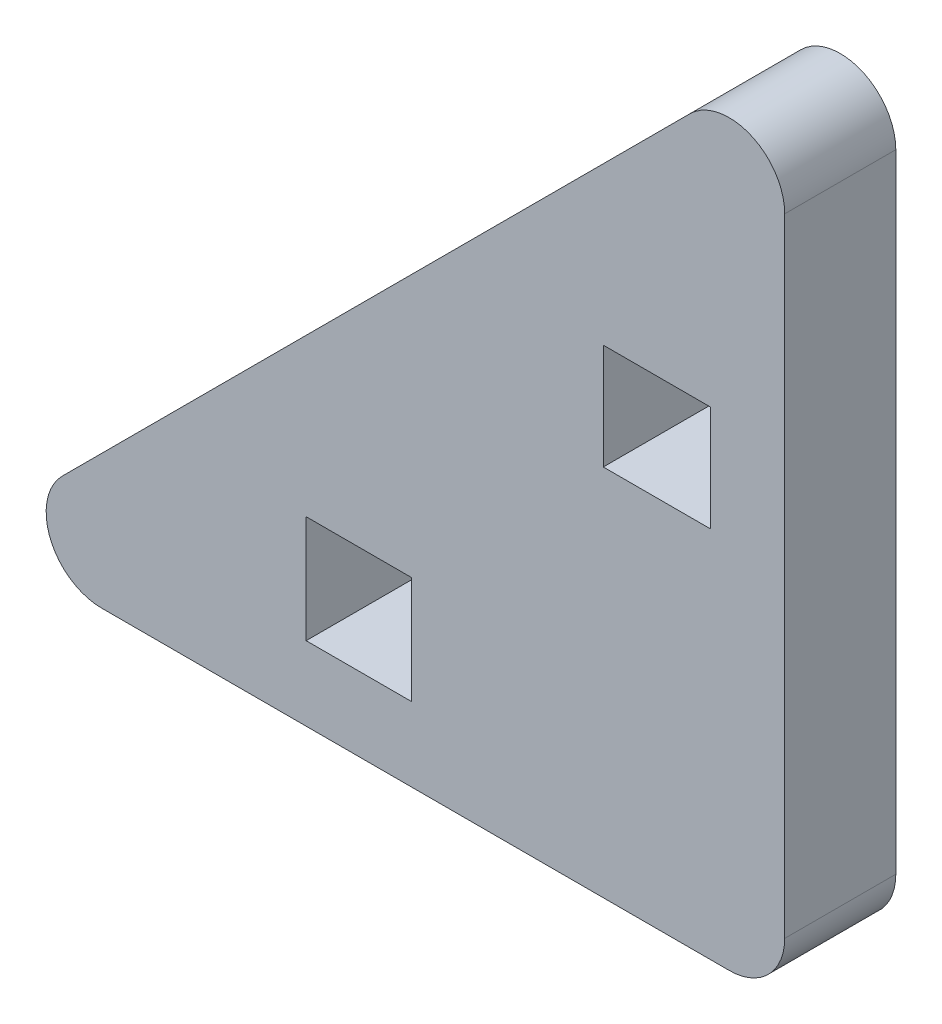
ISO-10303-21;
HEADER;
FILE_DESCRIPTION(('STEP AP214'),'2;1');
FILE_NAME('part.step','',(''),(''),'','','');
FILE_SCHEMA(('AUTOMOTIVE_DESIGN { 1 0 10303 214 1 1 1 1 }'));
ENDSEC;
DATA;
#1=APPLICATION_CONTEXT('core data for automotive mechanical design processes');
#2=APPLICATION_PROTOCOL_DEFINITION('international standard','automotive_design',2000,#1);
#3=PRODUCT_CONTEXT('',#1,'mechanical');
#4=PRODUCT('Part','Part','',(#3));
#5=PRODUCT_RELATED_PRODUCT_CATEGORY('part','',(#4));
#6=PRODUCT_DEFINITION_FORMATION('','',#4);
#7=PRODUCT_DEFINITION_CONTEXT('part definition',#1,'design');
#8=PRODUCT_DEFINITION('design','',#6,#7);
#9=PRODUCT_DEFINITION_SHAPE('','',#8);
#10=(LENGTH_UNIT() NAMED_UNIT(*) SI_UNIT(.MILLI.,.METRE.));
#11=(NAMED_UNIT(*) PLANE_ANGLE_UNIT() SI_UNIT($,.RADIAN.));
#12=(NAMED_UNIT(*) SI_UNIT($,.STERADIAN.) SOLID_ANGLE_UNIT());
#13=UNCERTAINTY_MEASURE_WITH_UNIT(LENGTH_MEASURE(1.E-05),#10,'distance_accuracy_value','');
#14=(GEOMETRIC_REPRESENTATION_CONTEXT(3) GLOBAL_UNCERTAINTY_ASSIGNED_CONTEXT((#13)) GLOBAL_UNIT_ASSIGNED_CONTEXT((#10,
#11,#12)) REPRESENTATION_CONTEXT('',''));
#15=CARTESIAN_POINT('',(0.,0.,0.));
#16=DIRECTION('',(0.,0.,1.));
#17=DIRECTION('',(1.,0.,0.));
#18=AXIS2_PLACEMENT_3D('',#15,#16,#17);
#19=CARTESIAN_POINT('',(0.,0.,3.));
#20=DIRECTION('',(1.,0.,0.));
#21=DIRECTION('',(0.,1.,0.));
#22=AXIS2_PLACEMENT_3D('',#19,#20,#21);
#23=PLANE('',#22);
#24=DIRECTION('',(0.,-1.,0.));
#25=VECTOR('',#24,1.);
#26=CARTESIAN_POINT('',(0.,0.,3.));
#27=LINE('',#26,#25);
#28=CARTESIAN_POINT('',(0.,18.4463203435596,3.));
#29=VERTEX_POINT('',#28);
#30=CARTESIAN_POINT('',(0.,1.5,3.));
#31=VERTEX_POINT('',#30);
#32=EDGE_CURVE('E195',#29,#31,#27,.T.);
#33=ORIENTED_EDGE('',*,*,#32,.T.);
#34=DIRECTION('',(0.,0.,-1.));
#35=VECTOR('',#34,1.);
#36=CARTESIAN_POINT('',(0.,1.5,3.));
#37=LINE('',#36,#35);
#38=CARTESIAN_POINT('',(0.,1.5,0.));
#39=VERTEX_POINT('',#38);
#40=EDGE_CURVE('E269',#31,#39,#37,.T.);
#41=ORIENTED_EDGE('',*,*,#40,.T.);
#42=DIRECTION('',(0.,-1.,0.));
#43=VECTOR('',#42,1.);
#44=CARTESIAN_POINT('',(0.,0.,0.));
#45=LINE('',#44,#43);
#46=CARTESIAN_POINT('',(0.,18.4463203435596,0.));
#47=VERTEX_POINT('',#46);
#48=EDGE_CURVE('E235',#47,#39,#45,.T.);
#49=ORIENTED_EDGE('',*,*,#48,.F.);
#50=DIRECTION('',(0.,0.,-1.));
#51=VECTOR('',#50,1.);
#52=CARTESIAN_POINT('',(0.,18.4463203435596,3.));
#53=LINE('',#52,#51);
#54=EDGE_CURVE('E258',#47,#29,#53,.F.);
#55=ORIENTED_EDGE('',*,*,#54,.T.);
#56=EDGE_LOOP('',(#33,#41,#49,#55));
#57=FACE_BOUND('',#56,.T.);
#58=ADVANCED_FACE('F43',(#57),#23,.T.);
#59=CARTESIAN_POINT('',(-11.0338203435596,11.0338203435596,3.));
#60=DIRECTION('',(-0.707106781186547,0.707106781186547,0.));
#61=DIRECTION('',(-0.707106781186548,-0.707106781186548,0.));
#62=AXIS2_PLACEMENT_3D('',#59,#60,#61);
#63=PLANE('',#62);
#64=DIRECTION('',(0.707106781186548,0.707106781186548,0.));
#65=VECTOR('',#64,1.);
#66=CARTESIAN_POINT('',(-11.0338203435596,11.0338203435596,0.));
#67=LINE('',#66,#65);
#68=CARTESIAN_POINT('',(-19.5069805153395,2.56066017177982,0.));
#69=VERTEX_POINT('',#68);
#70=CARTESIAN_POINT('',(-2.56066017177982,19.5069805153395,0.));
#71=VERTEX_POINT('',#70);
#72=EDGE_CURVE('E239',#69,#71,#67,.T.);
#73=ORIENTED_EDGE('',*,*,#72,.F.);
#74=DIRECTION('',(0.,0.,-1.));
#75=VECTOR('',#74,1.);
#76=CARTESIAN_POINT('',(-19.5069805153395,2.56066017177982,3.));
#77=LINE('',#76,#75);
#78=CARTESIAN_POINT('',(-19.5069805153395,2.56066017177982,3.));
#79=VERTEX_POINT('',#78);
#80=EDGE_CURVE('E11',#69,#79,#77,.F.);
#81=ORIENTED_EDGE('',*,*,#80,.T.);
#82=DIRECTION('',(0.707106781186548,0.707106781186548,0.));
#83=VECTOR('',#82,1.);
#84=CARTESIAN_POINT('',(-11.0338203435596,11.0338203435596,3.));
#85=LINE('',#84,#83);
#86=CARTESIAN_POINT('',(-2.56066017177982,19.5069805153395,3.));
#87=VERTEX_POINT('',#86);
#88=EDGE_CURVE('E199',#79,#87,#85,.T.);
#89=ORIENTED_EDGE('',*,*,#88,.T.);
#90=DIRECTION('',(0.,0.,-1.));
#91=VECTOR('',#90,1.);
#92=CARTESIAN_POINT('',(-2.56066017177982,19.5069805153395,3.));
#93=LINE('',#92,#91);
#94=EDGE_CURVE('E52',#87,#71,#93,.T.);
#95=ORIENTED_EDGE('',*,*,#94,.T.);
#96=EDGE_LOOP('',(#73,#81,#89,#95));
#97=FACE_BOUND('',#96,.T.);
#98=ADVANCED_FACE('F299',(#97),#63,.T.);
#99=CARTESIAN_POINT('',(-2.00000000000001,0.,3.));
#100=DIRECTION('',(-1.,0.,0.));
#101=DIRECTION('',(0.,-1.,0.));
#102=AXIS2_PLACEMENT_3D('',#99,#100,#101);
#103=PLANE('',#102);
#104=DIRECTION('',(0.,1.,0.));
#105=VECTOR('',#104,1.);
#106=CARTESIAN_POINT('',(-2.00000000000001,0.,0.));
#107=LINE('',#106,#105);
#108=CARTESIAN_POINT('',(-2.,10.075,0.));
#109=VERTEX_POINT('',#108);
#110=CARTESIAN_POINT('',(-2.,12.925,0.));
#111=VERTEX_POINT('',#110);
#112=EDGE_CURVE('E219',#109,#111,#107,.T.);
#113=ORIENTED_EDGE('',*,*,#112,.F.);
#114=DIRECTION('',(0.,0.,-1.));
#115=VECTOR('',#114,1.);
#116=CARTESIAN_POINT('',(-2.,10.075,3.));
#117=LINE('',#116,#115);
#118=CARTESIAN_POINT('',(-2.,10.075,3.));
#119=VERTEX_POINT('',#118);
#120=EDGE_CURVE('E255',#119,#109,#117,.T.);
#121=ORIENTED_EDGE('',*,*,#120,.F.);
#122=DIRECTION('',(0.,1.,0.));
#123=VECTOR('',#122,1.);
#124=CARTESIAN_POINT('',(-2.00000000000001,0.,3.));
#125=LINE('',#124,#123);
#126=CARTESIAN_POINT('',(-2.,12.925,3.));
#127=VERTEX_POINT('',#126);
#128=EDGE_CURVE('E180',#119,#127,#125,.T.);
#129=ORIENTED_EDGE('',*,*,#128,.T.);
#130=DIRECTION('',(0.,0.,-1.));
#131=VECTOR('',#130,1.);
#132=CARTESIAN_POINT('',(-2.,12.925,3.));
#133=LINE('',#132,#131);
#134=EDGE_CURVE('E156',#127,#111,#133,.T.);
#135=ORIENTED_EDGE('',*,*,#134,.T.);
#136=EDGE_LOOP('',(#113,#121,#129,#135));
#137=FACE_BOUND('',#136,.T.);
#138=ADVANCED_FACE('F328',(#137),#103,.T.);
#139=CARTESIAN_POINT('',(0.,10.075,3.));
#140=DIRECTION('',(0.,1.,0.));
#141=DIRECTION('',(-1.,0.,0.));
#142=AXIS2_PLACEMENT_3D('',#139,#140,#141);
#143=PLANE('',#142);
#144=DIRECTION('',(1.,0.,0.));
#145=VECTOR('',#144,1.);
#146=CARTESIAN_POINT('',(0.,10.075,0.));
#147=LINE('',#146,#145);
#148=CARTESIAN_POINT('',(-4.9,10.075,0.));
#149=VERTEX_POINT('',#148);
#150=EDGE_CURVE('E223',#149,#109,#147,.T.);
#151=ORIENTED_EDGE('',*,*,#150,.F.);
#152=DIRECTION('',(0.,0.,-1.));
#153=VECTOR('',#152,1.);
#154=CARTESIAN_POINT('',(-4.9,10.075,3.));
#155=LINE('',#154,#153);
#156=CARTESIAN_POINT('',(-4.9,10.075,3.));
#157=VERTEX_POINT('',#156);
#158=EDGE_CURVE('E252',#157,#149,#155,.T.);
#159=ORIENTED_EDGE('',*,*,#158,.F.);
#160=DIRECTION('',(1.,0.,0.));
#161=VECTOR('',#160,1.);
#162=CARTESIAN_POINT('',(0.,10.075,3.));
#163=LINE('',#162,#161);
#164=EDGE_CURVE('E184',#157,#119,#163,.T.);
#165=ORIENTED_EDGE('',*,*,#164,.T.);
#166=ORIENTED_EDGE('',*,*,#120,.T.);
#167=EDGE_LOOP('',(#151,#159,#165,#166));
#168=FACE_BOUND('',#167,.T.);
#169=ADVANCED_FACE('F341',(#168),#143,.T.);
#170=CARTESIAN_POINT('',(-4.9,0.,3.));
#171=DIRECTION('',(-1.,0.,0.));
#172=DIRECTION('',(0.,0.,1.));
#173=AXIS2_PLACEMENT_3D('',#170,#171,#172);
#174=PLANE('',#173);
#175=DIRECTION('',(0.,1.,0.));
#176=VECTOR('',#175,1.);
#177=CARTESIAN_POINT('',(-4.9,0.,0.));
#178=LINE('',#177,#176);
#179=CARTESIAN_POINT('',(-4.9,12.925,0.));
#180=VERTEX_POINT('',#179);
#181=EDGE_CURVE('E227',#149,#180,#178,.T.);
#182=ORIENTED_EDGE('',*,*,#181,.T.);
#183=DIRECTION('',(0.,0.,-1.));
#184=VECTOR('',#183,1.);
#185=CARTESIAN_POINT('',(-4.9,12.925,3.));
#186=LINE('',#185,#184);
#187=CARTESIAN_POINT('',(-4.9,12.925,3.));
#188=VERTEX_POINT('',#187);
#189=EDGE_CURVE('E248',#188,#180,#186,.T.);
#190=ORIENTED_EDGE('',*,*,#189,.F.);
#191=DIRECTION('',(0.,1.,0.));
#192=VECTOR('',#191,1.);
#193=CARTESIAN_POINT('',(-4.9,0.,3.));
#194=LINE('',#193,#192);
#195=EDGE_CURVE('E188',#157,#188,#194,.T.);
#196=ORIENTED_EDGE('',*,*,#195,.F.);
#197=ORIENTED_EDGE('',*,*,#158,.T.);
#198=EDGE_LOOP('',(#182,#190,#196,#197));
#199=FACE_BOUND('',#198,.T.);
#200=ADVANCED_FACE('F338',(#199),#174,.F.);
#201=CARTESIAN_POINT('',(-10.075,0.,3.));
#202=DIRECTION('',(-1.,0.,0.));
#203=DIRECTION('',(0.,0.,1.));
#204=AXIS2_PLACEMENT_3D('',#201,#202,#203);
#205=PLANE('',#204);
#206=DIRECTION('',(0.,1.,0.));
#207=VECTOR('',#206,1.);
#208=CARTESIAN_POINT('',(-10.075,0.,0.));
#209=LINE('',#208,#207);
#210=CARTESIAN_POINT('',(-10.075,2.,0.));
#211=VERTEX_POINT('',#210);
#212=CARTESIAN_POINT('',(-10.075,4.9,0.));
#213=VERTEX_POINT('',#212);
#214=EDGE_CURVE('E150',#211,#213,#209,.T.);
#215=ORIENTED_EDGE('',*,*,#214,.F.);
#216=DIRECTION('',(0.,0.,-1.));
#217=VECTOR('',#216,1.);
#218=CARTESIAN_POINT('',(-10.075,2.,3.));
#219=LINE('',#218,#217);
#220=CARTESIAN_POINT('',(-10.075,2.,3.));
#221=VERTEX_POINT('',#220);
#222=EDGE_CURVE('E145',#221,#211,#219,.T.);
#223=ORIENTED_EDGE('',*,*,#222,.F.);
#224=DIRECTION('',(0.,1.,0.));
#225=VECTOR('',#224,1.);
#226=CARTESIAN_POINT('',(-10.075,0.,3.));
#227=LINE('',#226,#225);
#228=CARTESIAN_POINT('',(-10.075,4.9,3.));
#229=VERTEX_POINT('',#228);
#230=EDGE_CURVE('E148',#221,#229,#227,.T.);
#231=ORIENTED_EDGE('',*,*,#230,.T.);
#232=DIRECTION('',(0.,0.,-1.));
#233=VECTOR('',#232,1.);
#234=CARTESIAN_POINT('',(-10.075,4.9,3.));
#235=LINE('',#234,#233);
#236=EDGE_CURVE('E206',#229,#213,#235,.T.);
#237=ORIENTED_EDGE('',*,*,#236,.T.);
#238=EDGE_LOOP('',(#215,#223,#231,#237));
#239=FACE_BOUND('',#238,.T.);
#240=ADVANCED_FACE('F147',(#239),#205,.T.);
#241=CARTESIAN_POINT('',(0.,2.,3.));
#242=DIRECTION('',(0.,1.,0.));
#243=DIRECTION('',(0.,0.,1.));
#244=AXIS2_PLACEMENT_3D('',#241,#242,#243);
#245=PLANE('',#244);
#246=DIRECTION('',(1.,0.,0.));
#247=VECTOR('',#246,1.);
#248=CARTESIAN_POINT('',(0.,2.,0.));
#249=LINE('',#248,#247);
#250=CARTESIAN_POINT('',(-12.925,2.,0.));
#251=VERTEX_POINT('',#250);
#252=EDGE_CURVE('E209',#251,#211,#249,.T.);
#253=ORIENTED_EDGE('',*,*,#252,.F.);
#254=DIRECTION('',(0.,0.,-1.));
#255=VECTOR('',#254,1.);
#256=CARTESIAN_POINT('',(-12.925,2.,3.));
#257=LINE('',#256,#255);
#258=CARTESIAN_POINT('',(-12.925,2.,3.));
#259=VERTEX_POINT('',#258);
#260=EDGE_CURVE('E157',#259,#251,#257,.T.);
#261=ORIENTED_EDGE('',*,*,#260,.F.);
#262=DIRECTION('',(1.,0.,0.));
#263=VECTOR('',#262,1.);
#264=CARTESIAN_POINT('',(0.,2.,3.));
#265=LINE('',#264,#263);
#266=EDGE_CURVE('E163',#259,#221,#265,.T.);
#267=ORIENTED_EDGE('',*,*,#266,.T.);
#268=ORIENTED_EDGE('',*,*,#222,.T.);
#269=EDGE_LOOP('',(#253,#261,#267,#268));
#270=FACE_BOUND('',#269,.T.);
#271=ADVANCED_FACE('F170',(#270),#245,.T.);
#272=CARTESIAN_POINT('',(-12.925,0.,3.));
#273=DIRECTION('',(-1.,0.,0.));
#274=DIRECTION('',(0.,0.,1.));
#275=AXIS2_PLACEMENT_3D('',#272,#273,#274);
#276=PLANE('',#275);
#277=DIRECTION('',(0.,1.,0.));
#278=VECTOR('',#277,1.);
#279=CARTESIAN_POINT('',(-12.925,0.,0.));
#280=LINE('',#279,#278);
#281=CARTESIAN_POINT('',(-12.925,4.9,0.));
#282=VERTEX_POINT('',#281);
#283=EDGE_CURVE('E212',#251,#282,#280,.T.);
#284=ORIENTED_EDGE('',*,*,#283,.T.);
#285=DIRECTION('',(0.,0.,-1.));
#286=VECTOR('',#285,1.);
#287=CARTESIAN_POINT('',(-12.925,4.9,3.));
#288=LINE('',#287,#286);
#289=CARTESIAN_POINT('',(-12.925,4.9,3.));
#290=VERTEX_POINT('',#289);
#291=EDGE_CURVE('E261',#290,#282,#288,.T.);
#292=ORIENTED_EDGE('',*,*,#291,.F.);
#293=DIRECTION('',(0.,1.,0.));
#294=VECTOR('',#293,1.);
#295=CARTESIAN_POINT('',(-12.925,0.,3.));
#296=LINE('',#295,#294);
#297=EDGE_CURVE('E173',#259,#290,#296,.T.);
#298=ORIENTED_EDGE('',*,*,#297,.F.);
#299=ORIENTED_EDGE('',*,*,#260,.T.);
#300=EDGE_LOOP('',(#284,#292,#298,#299));
#301=FACE_BOUND('',#300,.T.);
#302=ADVANCED_FACE('F336',(#301),#276,.F.);
#303=CARTESIAN_POINT('',(0.,12.925,3.));
#304=DIRECTION('',(0.,1.,0.));
#305=DIRECTION('',(0.,0.,1.));
#306=AXIS2_PLACEMENT_3D('',#303,#304,#305);
#307=PLANE('',#306);
#308=DIRECTION('',(1.,0.,0.));
#309=VECTOR('',#308,1.);
#310=CARTESIAN_POINT('',(0.,12.925,0.));
#311=LINE('',#310,#309);
#312=EDGE_CURVE('E231',#180,#111,#311,.T.);
#313=ORIENTED_EDGE('',*,*,#312,.T.);
#314=ORIENTED_EDGE('',*,*,#134,.F.);
#315=DIRECTION('',(1.,0.,0.));
#316=VECTOR('',#315,1.);
#317=CARTESIAN_POINT('',(0.,12.925,3.));
#318=LINE('',#317,#316);
#319=EDGE_CURVE('E192',#188,#127,#318,.T.);
#320=ORIENTED_EDGE('',*,*,#319,.F.);
#321=ORIENTED_EDGE('',*,*,#189,.T.);
#322=EDGE_LOOP('',(#313,#314,#320,#321));
#323=FACE_BOUND('',#322,.T.);
#324=ADVANCED_FACE('F332',(#323),#307,.F.);
#325=CARTESIAN_POINT('',(0.,4.9,3.));
#326=DIRECTION('',(0.,1.,0.));
#327=DIRECTION('',(0.,0.,1.));
#328=AXIS2_PLACEMENT_3D('',#325,#326,#327);
#329=PLANE('',#328);
#330=DIRECTION('',(1.,0.,0.));
#331=VECTOR('',#330,1.);
#332=CARTESIAN_POINT('',(0.,4.9,0.));
#333=LINE('',#332,#331);
#334=EDGE_CURVE('E215',#282,#213,#333,.T.);
#335=ORIENTED_EDGE('',*,*,#334,.T.);
#336=ORIENTED_EDGE('',*,*,#236,.F.);
#337=DIRECTION('',(1.,0.,0.));
#338=VECTOR('',#337,1.);
#339=CARTESIAN_POINT('',(0.,4.9,3.));
#340=LINE('',#339,#338);
#341=EDGE_CURVE('E165',#290,#229,#340,.T.);
#342=ORIENTED_EDGE('',*,*,#341,.F.);
#343=ORIENTED_EDGE('',*,*,#291,.T.);
#344=EDGE_LOOP('',(#335,#336,#342,#343));
#345=FACE_BOUND('',#344,.T.);
#346=ADVANCED_FACE('F335',(#345),#329,.F.);
#347=CARTESIAN_POINT('',(0.,0.,3.));
#348=DIRECTION('',(0.,-1.,0.));
#349=DIRECTION('',(0.,0.,-1.));
#350=AXIS2_PLACEMENT_3D('',#347,#348,#349);
#351=PLANE('',#350);
#352=DIRECTION('',(-1.,0.,0.));
#353=VECTOR('',#352,1.);
#354=CARTESIAN_POINT('',(0.,0.,0.));
#355=LINE('',#354,#353);
#356=CARTESIAN_POINT('',(-1.5,0.,0.));
#357=VERTEX_POINT('',#356);
#358=CARTESIAN_POINT('',(-18.4463203435596,0.,0.));
#359=VERTEX_POINT('',#358);
#360=EDGE_CURVE('E168',#357,#359,#355,.T.);
#361=ORIENTED_EDGE('',*,*,#360,.F.);
#362=DIRECTION('',(0.,0.,-1.));
#363=VECTOR('',#362,1.);
#364=CARTESIAN_POINT('',(-1.5,0.,3.));
#365=LINE('',#364,#363);
#366=CARTESIAN_POINT('',(-1.5,0.,3.));
#367=VERTEX_POINT('',#366);
#368=EDGE_CURVE('E286',#357,#367,#365,.F.);
#369=ORIENTED_EDGE('',*,*,#368,.T.);
#370=DIRECTION('',(-1.,0.,0.));
#371=VECTOR('',#370,1.);
#372=CARTESIAN_POINT('',(0.,0.,3.));
#373=LINE('',#372,#371);
#374=CARTESIAN_POINT('',(-18.4463203435596,0.,3.));
#375=VERTEX_POINT('',#374);
#376=EDGE_CURVE('E202',#367,#375,#373,.T.);
#377=ORIENTED_EDGE('',*,*,#376,.T.);
#378=DIRECTION('',(0.,0.,-1.));
#379=VECTOR('',#378,1.);
#380=CARTESIAN_POINT('',(-18.4463203435596,0.,3.));
#381=LINE('',#380,#379);
#382=EDGE_CURVE('E282',#375,#359,#381,.T.);
#383=ORIENTED_EDGE('',*,*,#382,.T.);
#384=EDGE_LOOP('',(#361,#369,#377,#383));
#385=FACE_BOUND('',#384,.T.);
#386=ADVANCED_FACE('F310',(#385),#351,.T.);
#387=CARTESIAN_POINT('',(0.,0.,3.));
#388=DIRECTION('',(0.,0.,1.));
#389=DIRECTION('',(1.,0.,0.));
#390=AXIS2_PLACEMENT_3D('',#387,#388,#389);
#391=PLANE('',#390);
#392=ORIENTED_EDGE('',*,*,#230,.F.);
#393=ORIENTED_EDGE('',*,*,#266,.F.);
#394=ORIENTED_EDGE('',*,*,#297,.T.);
#395=ORIENTED_EDGE('',*,*,#341,.T.);
#396=EDGE_LOOP('',(#392,#393,#394,#395));
#397=FACE_BOUND('',#396,.T.);
#398=ORIENTED_EDGE('',*,*,#128,.F.);
#399=ORIENTED_EDGE('',*,*,#164,.F.);
#400=ORIENTED_EDGE('',*,*,#195,.T.);
#401=ORIENTED_EDGE('',*,*,#319,.T.);
#402=EDGE_LOOP('',(#398,#399,#400,#401));
#403=FACE_BOUND('',#402,.T.);
#404=ORIENTED_EDGE('',*,*,#376,.F.);
#405=CARTESIAN_POINT('',(-1.5,1.5,3.));
#406=DIRECTION('',(0.,0.,1.));
#407=DIRECTION('',(1.,0.,0.));
#408=AXIS2_PLACEMENT_3D('',#405,#406,#407);
#409=CIRCLE('',#408,1.5);
#410=EDGE_CURVE('E294',#367,#31,#409,.T.);
#411=ORIENTED_EDGE('',*,*,#410,.T.);
#412=ORIENTED_EDGE('',*,*,#32,.F.);
#413=CARTESIAN_POINT('',(-1.5,18.4463203435596,3.));
#414=DIRECTION('',(0.,0.,1.));
#415=DIRECTION('',(1.,0.,0.));
#416=AXIS2_PLACEMENT_3D('',#413,#414,#415);
#417=CIRCLE('',#416,1.5);
#418=EDGE_CURVE('E59',#29,#87,#417,.T.);
#419=ORIENTED_EDGE('',*,*,#418,.T.);
#420=ORIENTED_EDGE('',*,*,#88,.F.);
#421=CARTESIAN_POINT('',(-18.4463203435596,1.5,3.));
#422=DIRECTION('',(0.,0.,1.));
#423=DIRECTION('',(1.,0.,0.));
#424=AXIS2_PLACEMENT_3D('',#421,#422,#423);
#425=CIRCLE('',#424,1.5);
#426=EDGE_CURVE('E291',#79,#375,#425,.T.);
#427=ORIENTED_EDGE('',*,*,#426,.T.);
#428=EDGE_LOOP('',(#404,#411,#412,#419,#420,#427));
#429=FACE_BOUND('',#428,.T.);
#430=ADVANCED_FACE('F161',(#397,#403,#429),#391,.T.);
#431=CARTESIAN_POINT('',(0.,0.,0.));
#432=DIRECTION('',(0.,0.,1.));
#433=DIRECTION('',(1.,0.,0.));
#434=AXIS2_PLACEMENT_3D('',#431,#432,#433);
#435=PLANE('',#434);
#436=ORIENTED_EDGE('',*,*,#214,.T.);
#437=ORIENTED_EDGE('',*,*,#334,.F.);
#438=ORIENTED_EDGE('',*,*,#283,.F.);
#439=ORIENTED_EDGE('',*,*,#252,.T.);
#440=EDGE_LOOP('',(#436,#437,#438,#439));
#441=FACE_BOUND('',#440,.T.);
#442=ORIENTED_EDGE('',*,*,#112,.T.);
#443=ORIENTED_EDGE('',*,*,#312,.F.);
#444=ORIENTED_EDGE('',*,*,#181,.F.);
#445=ORIENTED_EDGE('',*,*,#150,.T.);
#446=EDGE_LOOP('',(#442,#443,#444,#445));
#447=FACE_BOUND('',#446,.T.);
#448=ORIENTED_EDGE('',*,*,#48,.T.);
#449=CARTESIAN_POINT('',(-1.5,1.5,0.));
#450=DIRECTION('',(0.,0.,1.));
#451=DIRECTION('',(1.,0.,0.));
#452=AXIS2_PLACEMENT_3D('',#449,#450,#451);
#453=CIRCLE('',#452,1.5);
#454=EDGE_CURVE('E279',#39,#357,#453,.F.);
#455=ORIENTED_EDGE('',*,*,#454,.T.);
#456=ORIENTED_EDGE('',*,*,#360,.T.);
#457=CARTESIAN_POINT('',(-18.4463203435596,1.5,0.));
#458=DIRECTION('',(0.,0.,1.));
#459=DIRECTION('',(1.,0.,0.));
#460=AXIS2_PLACEMENT_3D('',#457,#458,#459);
#461=CIRCLE('',#460,1.5);
#462=EDGE_CURVE('E276',#359,#69,#461,.F.);
#463=ORIENTED_EDGE('',*,*,#462,.T.);
#464=ORIENTED_EDGE('',*,*,#72,.T.);
#465=CARTESIAN_POINT('',(-1.5,18.4463203435596,0.));
#466=DIRECTION('',(0.,0.,1.));
#467=DIRECTION('',(1.,0.,0.));
#468=AXIS2_PLACEMENT_3D('',#465,#466,#467);
#469=CIRCLE('',#468,1.5);
#470=EDGE_CURVE('E273',#71,#47,#469,.F.);
#471=ORIENTED_EDGE('',*,*,#470,.T.);
#472=EDGE_LOOP('',(#448,#455,#456,#463,#464,#471));
#473=FACE_BOUND('',#472,.T.);
#474=ADVANCED_FACE('F302',(#441,#447,#473),#435,.F.);
#475=CARTESIAN_POINT('',(-1.5,1.5,3.));
#476=DIRECTION('',(0.,0.,-1.));
#477=DIRECTION('',(-1.,0.,0.));
#478=AXIS2_PLACEMENT_3D('',#475,#476,#477);
#479=CYLINDRICAL_SURFACE('',#478,1.5);
#480=ORIENTED_EDGE('',*,*,#410,.F.);
#481=ORIENTED_EDGE('',*,*,#368,.F.);
#482=ORIENTED_EDGE('',*,*,#454,.F.);
#483=ORIENTED_EDGE('',*,*,#40,.F.);
#484=EDGE_LOOP('',(#480,#481,#482,#483));
#485=FACE_BOUND('',#484,.T.);
#486=ADVANCED_FACE('F316',(#485),#479,.T.);
#487=CARTESIAN_POINT('',(-18.4463203435596,1.5,3.));
#488=DIRECTION('',(0.,0.,-1.));
#489=DIRECTION('',(-1.,0.,0.));
#490=AXIS2_PLACEMENT_3D('',#487,#488,#489);
#491=CYLINDRICAL_SURFACE('',#490,1.5);
#492=ORIENTED_EDGE('',*,*,#426,.F.);
#493=ORIENTED_EDGE('',*,*,#80,.F.);
#494=ORIENTED_EDGE('',*,*,#462,.F.);
#495=ORIENTED_EDGE('',*,*,#382,.F.);
#496=EDGE_LOOP('',(#492,#493,#494,#495));
#497=FACE_BOUND('',#496,.T.);
#498=ADVANCED_FACE('F308',(#497),#491,.T.);
#499=CARTESIAN_POINT('',(-1.5,18.4463203435596,3.));
#500=DIRECTION('',(0.,0.,-1.));
#501=DIRECTION('',(-1.,0.,0.));
#502=AXIS2_PLACEMENT_3D('',#499,#500,#501);
#503=CYLINDRICAL_SURFACE('',#502,1.5);
#504=ORIENTED_EDGE('',*,*,#418,.F.);
#505=ORIENTED_EDGE('',*,*,#54,.F.);
#506=ORIENTED_EDGE('',*,*,#470,.F.);
#507=ORIENTED_EDGE('',*,*,#94,.F.);
#508=EDGE_LOOP('',(#504,#505,#506,#507));
#509=FACE_BOUND('',#508,.T.);
#510=ADVANCED_FACE('F45',(#509),#503,.T.);
#511=CLOSED_SHELL('',(#58,#98,#138,#169,#200,#240,#271,#302,#324,#346,#386,#430,#474,#486,#498,#510));
#512=MANIFOLD_SOLID_BREP('B2',#511);
#513=ADVANCED_BREP_SHAPE_REPRESENTATION('',(#18,#512),#14);
#514=SHAPE_DEFINITION_REPRESENTATION(#9,#513);
ENDSEC;
END-ISO-10303-21;
